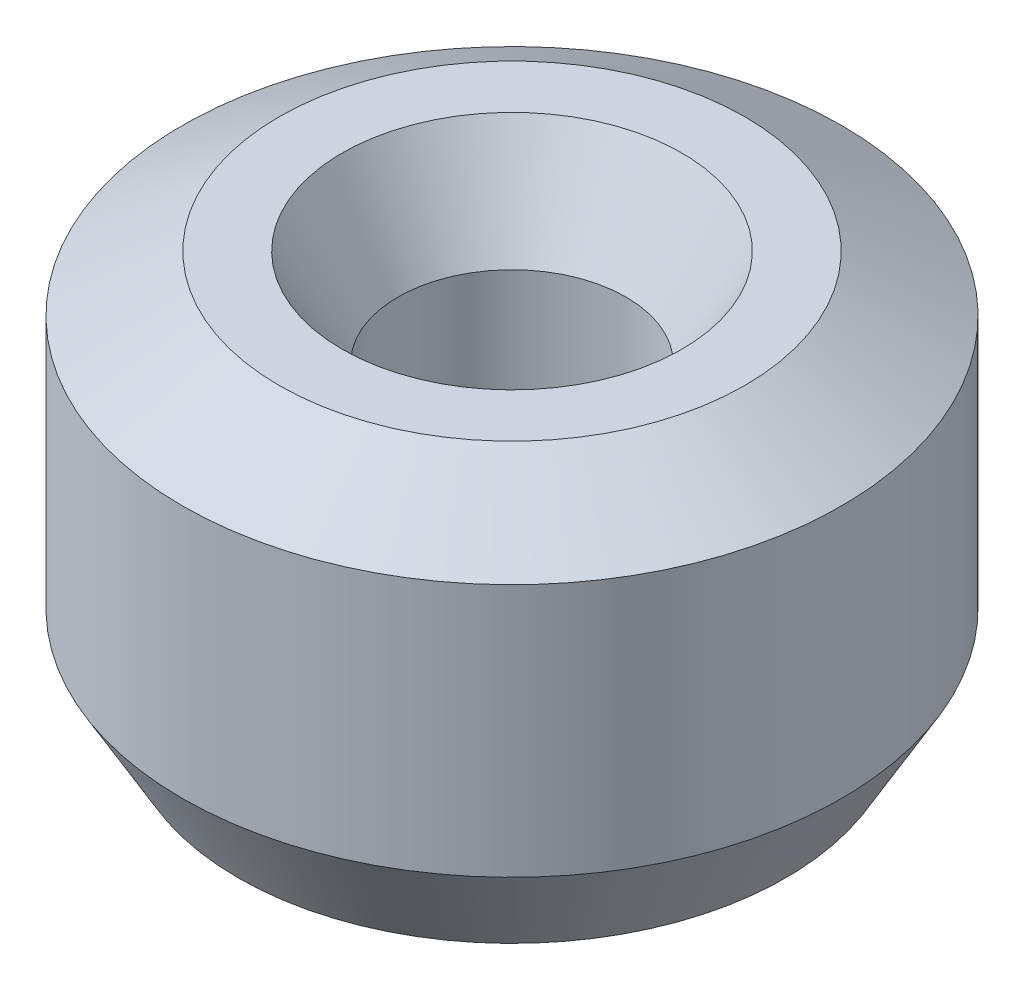
ISO-10303-21;
HEADER;
FILE_DESCRIPTION(('STEP AP214'),'2;1');
FILE_NAME('part.step','',(''),(''),'','','');
FILE_SCHEMA(('AUTOMOTIVE_DESIGN { 1 0 10303 214 1 1 1 1 }'));
ENDSEC;
DATA;
#1=APPLICATION_CONTEXT('core data for automotive mechanical design processes');
#2=APPLICATION_PROTOCOL_DEFINITION('international standard','automotive_design',2000,#1);
#3=PRODUCT_CONTEXT('',#1,'mechanical');
#4=PRODUCT('Part','Part','',(#3));
#5=PRODUCT_RELATED_PRODUCT_CATEGORY('part','',(#4));
#6=PRODUCT_DEFINITION_FORMATION('','',#4);
#7=PRODUCT_DEFINITION_CONTEXT('part definition',#1,'design');
#8=PRODUCT_DEFINITION('design','',#6,#7);
#9=PRODUCT_DEFINITION_SHAPE('','',#8);
#10=(LENGTH_UNIT() NAMED_UNIT(*) SI_UNIT(.MILLI.,.METRE.));
#11=(NAMED_UNIT(*) PLANE_ANGLE_UNIT() SI_UNIT($,.RADIAN.));
#12=(NAMED_UNIT(*) SI_UNIT($,.STERADIAN.) SOLID_ANGLE_UNIT());
#13=UNCERTAINTY_MEASURE_WITH_UNIT(LENGTH_MEASURE(1.E-05),#10,'distance_accuracy_value','');
#14=(GEOMETRIC_REPRESENTATION_CONTEXT(3) GLOBAL_UNCERTAINTY_ASSIGNED_CONTEXT((#13)) GLOBAL_UNIT_ASSIGNED_CONTEXT((#10,
#11,#12)) REPRESENTATION_CONTEXT('',''));
#15=CARTESIAN_POINT('',(0.,0.,0.));
#16=DIRECTION('',(0.,0.,1.));
#17=DIRECTION('',(1.,0.,0.));
#18=AXIS2_PLACEMENT_3D('',#15,#16,#17);
#19=CARTESIAN_POINT('',(0.,6.16033131752861,0.));
#20=DIRECTION('',(0.,-1.,0.));
#21=DIRECTION('',(0.,0.,-1.));
#22=AXIS2_PLACEMENT_3D('',#19,#20,#21);
#23=CYLINDRICAL_SURFACE('',#22,5.);
#24=CARTESIAN_POINT('',(0.,1.46824299427012,0.));
#25=DIRECTION('',(0.,1.,0.));
#26=DIRECTION('',(0.,0.,1.));
#27=AXIS2_PLACEMENT_3D('',#24,#25,#26);
#28=CIRCLE('',#27,5.);
#29=CARTESIAN_POINT('',(0.,1.46824299427012,-5.));
#30=VERTEX_POINT('',#29);
#31=EDGE_CURVE('E10',#30,#30,#28,.T.);
#32=CARTESIAN_POINT('',(0.,5.31264082955098,0.));
#33=DIRECTION('',(0.,1.,0.));
#34=DIRECTION('',(0.,0.,1.));
#35=AXIS2_PLACEMENT_3D('',#32,#33,#34);
#36=CIRCLE('',#35,5.);
#37=CARTESIAN_POINT('',(0.,5.31264082955098,-5.));
#38=VERTEX_POINT('',#37);
#39=EDGE_CURVE('E50',#38,#38,#36,.F.);
#40=CARTESIAN_POINT('',(0.,1.46824299427012,-5.));
#41=CARTESIAN_POINT('',(0.,1.5082888050543,-5.));
#42=CARTESIAN_POINT('',(0.,1.54833461583847,-5.));
#43=CARTESIAN_POINT('',(0.,1.62842623740682,-5.));
#44=CARTESIAN_POINT('',(0.,1.668472048191,-5.));
#45=CARTESIAN_POINT('',(0.,1.74856366975935,-5.));
#46=CARTESIAN_POINT('',(0.,1.78860948054353,-5.));
#47=CARTESIAN_POINT('',(0.,1.86870110211188,-5.));
#48=CARTESIAN_POINT('',(0.,1.90874691289605,-5.));
#49=CARTESIAN_POINT('',(0.,1.9888385344644,-5.));
#50=CARTESIAN_POINT('',(0.,2.02888434524858,-5.));
#51=CARTESIAN_POINT('',(0.,2.10897596681693,-5.));
#52=CARTESIAN_POINT('',(0.,2.14902177760111,-5.));
#53=CARTESIAN_POINT('',(0.,2.22911339916946,-5.));
#54=CARTESIAN_POINT('',(0.,2.26915920995363,-5.));
#55=CARTESIAN_POINT('',(0.,2.34925083152198,-5.));
#56=CARTESIAN_POINT('',(0.,2.38929664230616,-5.));
#57=CARTESIAN_POINT('',(0.,2.46938826387451,-5.));
#58=CARTESIAN_POINT('',(0.,2.50943407465869,-5.));
#59=CARTESIAN_POINT('',(0.,2.58952569622704,-5.));
#60=CARTESIAN_POINT('',(0.,2.62957150701121,-5.));
#61=CARTESIAN_POINT('',(0.,2.70966312857957,-5.));
#62=CARTESIAN_POINT('',(0.,2.74970893936374,-5.));
#63=CARTESIAN_POINT('',(0.,2.82980056093209,-5.));
#64=CARTESIAN_POINT('',(0.,2.86984637171627,-5.));
#65=CARTESIAN_POINT('',(0.,2.94993799328462,-5.));
#66=CARTESIAN_POINT('',(0.,2.98998380406879,-5.));
#67=CARTESIAN_POINT('',(0.,3.07007542563715,-5.));
#68=CARTESIAN_POINT('',(0.,3.11012123642132,-5.));
#69=CARTESIAN_POINT('',(0.,3.19021285798967,-5.));
#70=CARTESIAN_POINT('',(0.,3.23025866877385,-5.));
#71=CARTESIAN_POINT('',(0.,3.3103502903422,-5.));
#72=CARTESIAN_POINT('',(0.,3.35039610112638,-5.));
#73=CARTESIAN_POINT('',(0.,3.43048772269473,-5.));
#74=CARTESIAN_POINT('',(0.,3.4705335334789,-5.));
#75=CARTESIAN_POINT('',(0.,3.55062515504725,-5.));
#76=CARTESIAN_POINT('',(0.,3.59067096583143,-5.));
#77=CARTESIAN_POINT('',(0.,3.67076258739978,-5.));
#78=CARTESIAN_POINT('',(0.,3.71080839818396,-5.));
#79=CARTESIAN_POINT('',(0.,3.79090001975231,-5.));
#80=CARTESIAN_POINT('',(0.,3.83094583053648,-5.));
#81=CARTESIAN_POINT('',(0.,3.91103745210484,-5.));
#82=CARTESIAN_POINT('',(0.,3.95108326288901,-5.));
#83=CARTESIAN_POINT('',(0.,4.03117488445736,-5.));
#84=CARTESIAN_POINT('',(0.,4.07122069524154,-5.));
#85=CARTESIAN_POINT('',(0.,4.15131231680989,-5.));
#86=CARTESIAN_POINT('',(0.,4.19135812759406,-5.));
#87=CARTESIAN_POINT('',(0.,4.27144974916242,-5.));
#88=CARTESIAN_POINT('',(0.,4.31149555994659,-5.));
#89=CARTESIAN_POINT('',(0.,4.39158718151494,-5.));
#90=CARTESIAN_POINT('',(0.,4.43163299229912,-5.));
#91=CARTESIAN_POINT('',(0.,4.51172461386747,-5.));
#92=CARTESIAN_POINT('',(0.,4.55177042465165,-5.));
#93=CARTESIAN_POINT('',(0.,4.63186204622,-5.));
#94=CARTESIAN_POINT('',(0.,4.67190785700417,-5.));
#95=CARTESIAN_POINT('',(0.,4.75199947857252,-5.));
#96=CARTESIAN_POINT('',(0.,4.7920452893567,-5.));
#97=CARTESIAN_POINT('',(0.,4.87213691092505,-5.));
#98=CARTESIAN_POINT('',(0.,4.91218272170923,-5.));
#99=CARTESIAN_POINT('',(0.,4.99227434327758,-5.));
#100=CARTESIAN_POINT('',(0.,5.03232015406175,-5.));
#101=CARTESIAN_POINT('',(0.,5.1124117756301,-5.));
#102=CARTESIAN_POINT('',(0.,5.15245758641428,-5.));
#103=CARTESIAN_POINT('',(0.,5.23254920798263,-5.));
#104=CARTESIAN_POINT('',(0.,5.27259501876681,-5.));
#105=CARTESIAN_POINT('',(0.,5.31264082955098,-5.));
#106=B_SPLINE_CURVE_WITH_KNOTS('',3,(#40,#41,#42,#43,#44,#45,#46,#47,#48,#49,#50,#51,#52,#53,
#54,#55,#56,#57,#58,#59,#60,#61,#62,#63,#64,#65,#66,#67,#68,#69,#70,#71,#72,#73,#74,#75,#76,#77,
#78,#79,#80,#81,#82,#83,#84,#85,#86,#87,#88,#89,#90,#91,#92,#93,#94,#95,#96,#97,#98,#99,#100,
#101,#102,#103,#104,#105),.UNSPECIFIED.,.F.,.F.,(4,2,2,2,2,2,2,2,2,2,2,2,2,2,2,2,2,2,2,2,2,2,2,
2,2,2,2,2,2,2,2,2,4),(0.,0.120137432352527,0.240274864705054,0.360412297057581,
0.480549729410108,0.600687161762635,0.720824594115162,0.840962026467688,0.961099458820216,
1.08123689117274,1.20137432352527,1.3215117558778,1.44164918823032,1.56178662058285,
1.68192405293538,1.8020614852879,1.92219891764043,2.04233634999296,2.16247378234549,
2.28261121469801,2.40274864705054,2.52288607940307,2.64302351175559,2.76316094410812,
2.88329837646065,3.00343580881317,3.1235732411657,3.24371067351823,3.36384810587075,
3.48398553822328,3.60412297057581,3.72426040292834,3.84439783528086),.UNSPECIFIED.);
#107=EDGE_CURVE('BSEAM39',#30,#38,#106,.T.);
#108=ORIENTED_EDGE('',*,*,#31,.T.);
#109=ORIENTED_EDGE('',*,*,#39,.T.);
#110=ORIENTED_EDGE('',*,*,#107,.T.);
#111=ORIENTED_EDGE('',*,*,#107,.F.);
#112=EDGE_LOOP('',(#108,#110,#109,#111));
#113=FACE_BOUND('',#112,.T.);
#114=ADVANCED_FACE('F39',(#113),#23,.T.);
#115=CARTESIAN_POINT('',(0.,6.16033131752861,0.));
#116=DIRECTION('',(0.,1.,0.));
#117=DIRECTION('',(0.,0.,1.));
#118=AXIS2_PLACEMENT_3D('',#115,#116,#117);
#119=PLANE('',#118);
#120=CARTESIAN_POINT('',(0.,6.16033131752861,0.));
#121=DIRECTION('',(0.,1.,0.));
#122=DIRECTION('',(0.,0.,1.));
#123=AXIS2_PLACEMENT_3D('',#120,#121,#122);
#124=CIRCLE('',#123,2.57860352945368);
#125=CARTESIAN_POINT('',(0.,6.16033131752861,2.57860352945368));
#126=VERTEX_POINT('',#125);
#127=EDGE_CURVE('E58',#126,#126,#124,.F.);
#128=ORIENTED_EDGE('',*,*,#127,.T.);
#129=EDGE_LOOP('',(#128));
#130=FACE_BOUND('',#129,.T.);
#131=CARTESIAN_POINT('',(0.,6.16033131752861,0.));
#132=DIRECTION('',(0.,1.,0.));
#133=DIRECTION('',(0.,0.,1.));
#134=AXIS2_PLACEMENT_3D('',#131,#132,#133);
#135=CIRCLE('',#134,3.53175700572991);
#136=CARTESIAN_POINT('',(0.,6.16033131752861,3.53175700572991));
#137=VERTEX_POINT('',#136);
#138=EDGE_CURVE('E61',#137,#137,#135,.T.);
#139=ORIENTED_EDGE('',*,*,#138,.T.);
#140=EDGE_LOOP('',(#139));
#141=FACE_BOUND('',#140,.T.);
#142=ADVANCED_FACE('F88',(#130,#141),#119,.T.);
#143=CARTESIAN_POINT('',(0.,0.,0.));
#144=DIRECTION('',(0.,1.,0.));
#145=DIRECTION('',(0.,0.,1.));
#146=AXIS2_PLACEMENT_3D('',#143,#144,#145);
#147=PLANE('',#146);
#148=CARTESIAN_POINT('',(0.,0.,0.));
#149=DIRECTION('',(0.,1.,0.));
#150=DIRECTION('',(0.,0.,1.));
#151=AXIS2_PLACEMENT_3D('',#148,#149,#150);
#152=CIRCLE('',#151,3.19915603574612);
#153=CARTESIAN_POINT('',(0.,0.,3.19915603574612));
#154=VERTEX_POINT('',#153);
#155=EDGE_CURVE('E51',#154,#154,#152,.T.);
#156=ORIENTED_EDGE('',*,*,#155,.T.);
#157=EDGE_LOOP('',(#156));
#158=FACE_BOUND('',#157,.T.);
#159=CARTESIAN_POINT('',(0.,0.,0.));
#160=DIRECTION('',(0.,1.,0.));
#161=DIRECTION('',(0.,0.,1.));
#162=AXIS2_PLACEMENT_3D('',#159,#160,#161);
#163=CIRCLE('',#162,4.15230951202236);
#164=CARTESIAN_POINT('',(0.,0.,4.15230951202236));
#165=VERTEX_POINT('',#164);
#166=EDGE_CURVE('E54',#165,#165,#163,.F.);
#167=ORIENTED_EDGE('',*,*,#166,.T.);
#168=EDGE_LOOP('',(#167));
#169=FACE_BOUND('',#168,.T.);
#170=ADVANCED_FACE('F83',(#158,#169),#147,.F.);
#171=CARTESIAN_POINT('',(0.,6.16033131752861,0.));
#172=DIRECTION('',(0.,-1.,0.));
#173=DIRECTION('',(0.,0.,-1.));
#174=AXIS2_PLACEMENT_3D('',#171,#172,#173);
#175=CYLINDRICAL_SURFACE('',#174,1.73091304147604);
#176=CARTESIAN_POINT('',(0.,4.69208832325849,0.));
#177=DIRECTION('',(0.,1.,0.));
#178=DIRECTION('',(0.,0.,1.));
#179=AXIS2_PLACEMENT_3D('',#176,#177,#178);
#180=CIRCLE('',#179,1.73091304147604);
#181=CARTESIAN_POINT('',(0.,4.69208832325849,-1.73091304147604));
#182=VERTEX_POINT('',#181);
#183=EDGE_CURVE('E67',#182,#182,#180,.T.);
#184=CARTESIAN_POINT('',(0.,0.847690487977625,0.));
#185=DIRECTION('',(0.,1.,0.));
#186=DIRECTION('',(0.,0.,1.));
#187=AXIS2_PLACEMENT_3D('',#184,#185,#186);
#188=CIRCLE('',#187,1.73091304147604);
#189=CARTESIAN_POINT('',(0.,0.847690487977624,-1.73091304147604));
#190=VERTEX_POINT('',#189);
#191=EDGE_CURVE('E69',#190,#190,#188,.F.);
#192=CARTESIAN_POINT('',(0.,4.69208832325849,-1.73091304147604));
#193=CARTESIAN_POINT('',(0.,4.65204251247432,-1.73091304147604));
#194=CARTESIAN_POINT('',(0.,4.61199670169014,-1.73091304147604));
#195=CARTESIAN_POINT('',(0.,4.53190508012179,-1.73091304147604));
#196=CARTESIAN_POINT('',(0.,4.49185926933761,-1.73091304147604));
#197=CARTESIAN_POINT('',(0.,4.41176764776926,-1.73091304147604));
#198=CARTESIAN_POINT('',(0.,4.37172183698509,-1.73091304147604));
#199=CARTESIAN_POINT('',(0.,4.29163021541673,-1.73091304147604));
#200=CARTESIAN_POINT('',(0.,4.25158440463256,-1.73091304147604));
#201=CARTESIAN_POINT('',(0.,4.17149278306421,-1.73091304147604));
#202=CARTESIAN_POINT('',(0.,4.13144697228003,-1.73091304147604));
#203=CARTESIAN_POINT('',(0.,4.05135535071168,-1.73091304147604));
#204=CARTESIAN_POINT('',(0.,4.0113095399275,-1.73091304147604));
#205=CARTESIAN_POINT('',(0.,3.93121791835915,-1.73091304147604));
#206=CARTESIAN_POINT('',(0.,3.89117210757498,-1.73091304147604));
#207=CARTESIAN_POINT('',(0.,3.81108048600663,-1.73091304147604));
#208=CARTESIAN_POINT('',(0.,3.77103467522245,-1.73091304147604));
#209=CARTESIAN_POINT('',(0.,3.6909430536541,-1.73091304147604));
#210=CARTESIAN_POINT('',(0.,3.65089724286992,-1.73091304147604));
#211=CARTESIAN_POINT('',(0.,3.57080562130157,-1.73091304147604));
#212=CARTESIAN_POINT('',(0.,3.5307598105174,-1.73091304147604));
#213=CARTESIAN_POINT('',(0.,3.45066818894904,-1.73091304147604));
#214=CARTESIAN_POINT('',(0.,3.41062237816487,-1.73091304147604));
#215=CARTESIAN_POINT('',(0.,3.33053075659652,-1.73091304147604));
#216=CARTESIAN_POINT('',(0.,3.29048494581234,-1.73091304147604));
#217=CARTESIAN_POINT('',(0.,3.21039332424399,-1.73091304147604));
#218=CARTESIAN_POINT('',(0.,3.17034751345981,-1.73091304147604));
#219=CARTESIAN_POINT('',(0.,3.09025589189146,-1.73091304147604));
#220=CARTESIAN_POINT('',(0.,3.05021008110729,-1.73091304147604));
#221=CARTESIAN_POINT('',(0.,2.97011845953894,-1.73091304147604));
#222=CARTESIAN_POINT('',(0.,2.93007264875476,-1.73091304147604));
#223=CARTESIAN_POINT('',(0.,2.84998102718641,-1.73091304147604));
#224=CARTESIAN_POINT('',(0.,2.80993521640223,-1.73091304147604));
#225=CARTESIAN_POINT('',(0.,2.72984359483388,-1.73091304147604));
#226=CARTESIAN_POINT('',(0.,2.68979778404971,-1.73091304147604));
#227=CARTESIAN_POINT('',(0.,2.60970616248135,-1.73091304147604));
#228=CARTESIAN_POINT('',(0.,2.56966035169718,-1.73091304147604));
#229=CARTESIAN_POINT('',(0.,2.48956873012883,-1.73091304147604));
#230=CARTESIAN_POINT('',(0.,2.44952291934465,-1.73091304147604));
#231=CARTESIAN_POINT('',(0.,2.3694312977763,-1.73091304147604));
#232=CARTESIAN_POINT('',(0.,2.32938548699212,-1.73091304147604));
#233=CARTESIAN_POINT('',(0.,2.24929386542377,-1.73091304147604));
#234=CARTESIAN_POINT('',(0.,2.2092480546396,-1.73091304147604));
#235=CARTESIAN_POINT('',(0.,2.12915643307125,-1.73091304147604));
#236=CARTESIAN_POINT('',(0.,2.08911062228707,-1.73091304147604));
#237=CARTESIAN_POINT('',(0.,2.00901900071872,-1.73091304147604));
#238=CARTESIAN_POINT('',(0.,1.96897318993454,-1.73091304147604));
#239=CARTESIAN_POINT('',(0.,1.88888156836619,-1.73091304147604));
#240=CARTESIAN_POINT('',(0.,1.84883575758202,-1.73091304147604));
#241=CARTESIAN_POINT('',(0.,1.76874413601367,-1.73091304147604));
#242=CARTESIAN_POINT('',(0.,1.72869832522949,-1.73091304147604));
#243=CARTESIAN_POINT('',(0.,1.64860670366114,-1.73091304147604));
#244=CARTESIAN_POINT('',(0.,1.60856089287696,-1.73091304147604));
#245=CARTESIAN_POINT('',(0.,1.52846927130861,-1.73091304147604));
#246=CARTESIAN_POINT('',(0.,1.48842346052444,-1.73091304147604));
#247=CARTESIAN_POINT('',(0.,1.40833183895608,-1.73091304147604));
#248=CARTESIAN_POINT('',(0.,1.36828602817191,-1.73091304147604));
#249=CARTESIAN_POINT('',(0.,1.28819440660356,-1.73091304147604));
#250=CARTESIAN_POINT('',(0.,1.24814859581938,-1.73091304147604));
#251=CARTESIAN_POINT('',(0.,1.16805697425103,-1.73091304147604));
#252=CARTESIAN_POINT('',(0.,1.12801116346685,-1.73091304147604));
#253=CARTESIAN_POINT('',(0.,1.0479195418985,-1.73091304147604));
#254=CARTESIAN_POINT('',(0.,1.00787373111433,-1.73091304147604));
#255=CARTESIAN_POINT('',(0.,0.927782109545976,-1.73091304147604));
#256=CARTESIAN_POINT('',(0.,0.8877362987618,-1.73091304147604));
#257=CARTESIAN_POINT('',(0.,0.847690487977624,-1.73091304147604));
#258=B_SPLINE_CURVE_WITH_KNOTS('',3,(#192,#193,#194,#195,#196,#197,#198,#199,#200,#201,#202,
#203,#204,#205,#206,#207,#208,#209,#210,#211,#212,#213,#214,#215,#216,#217,#218,#219,#220,#221,
#222,#223,#224,#225,#226,#227,#228,#229,#230,#231,#232,#233,#234,#235,#236,#237,#238,#239,#240,
#241,#242,#243,#244,#245,#246,#247,#248,#249,#250,#251,#252,#253,#254,#255,#256,#257),
.UNSPECIFIED.,.F.,.F.,(4,2,2,2,2,2,2,2,2,2,2,2,2,2,2,2,2,2,2,2,2,2,2,2,2,2,2,2,2,2,2,2,4),(0.,
0.120137432352527,0.240274864705054,0.360412297057581,0.480549729410108,0.600687161762634,
0.720824594115163,0.840962026467689,0.961099458820217,1.08123689117274,1.20137432352527,
1.3215117558778,1.44164918823032,1.56178662058285,1.68192405293538,1.80206148528791,
1.92219891764043,2.04233634999296,2.16247378234549,2.28261121469801,2.40274864705054,
2.52288607940307,2.6430235117556,2.76316094410812,2.88329837646065,3.00343580881318,
3.1235732411657,3.24371067351823,3.36384810587076,3.48398553822329,3.60412297057581,
3.72426040292834,3.84439783528087),.UNSPECIFIED.);
#259=EDGE_CURVE('BSEAM71',#182,#190,#258,.T.);
#260=ORIENTED_EDGE('',*,*,#183,.T.);
#261=ORIENTED_EDGE('',*,*,#191,.T.);
#262=ORIENTED_EDGE('',*,*,#259,.T.);
#263=ORIENTED_EDGE('',*,*,#259,.F.);
#264=EDGE_LOOP('',(#260,#262,#261,#263));
#265=FACE_BOUND('',#264,.T.);
#266=ADVANCED_FACE('F71',(#265),#175,.F.);
#267=CARTESIAN_POINT('',(0.,4.69208832325849,0.));
#268=DIRECTION('',(0.,1.,0.));
#269=DIRECTION('',(0.,0.,1.));
#270=AXIS2_PLACEMENT_3D('',#267,#268,#269);
#271=CONICAL_SURFACE('',#270,1.73091304147604,0.523598775598302);
#272=ORIENTED_EDGE('',*,*,#127,.F.);
#273=EDGE_LOOP('',(#272));
#274=FACE_BOUND('',#273,.T.);
#275=ORIENTED_EDGE('',*,*,#183,.F.);
#276=EDGE_LOOP('',(#275));
#277=FACE_BOUND('',#276,.T.);
#278=ADVANCED_FACE('F77',(#274,#277),#271,.F.);
#279=CARTESIAN_POINT('',(0.,0.,0.));
#280=DIRECTION('',(0.,-1.,0.));
#281=DIRECTION('',(0.,0.,-1.));
#282=AXIS2_PLACEMENT_3D('',#279,#280,#281);
#283=CONICAL_SURFACE('',#282,3.19915603574612,1.04719755119659);
#284=ORIENTED_EDGE('',*,*,#191,.F.);
#285=EDGE_LOOP('',(#284));
#286=FACE_BOUND('',#285,.T.);
#287=ORIENTED_EDGE('',*,*,#155,.F.);
#288=EDGE_LOOP('',(#287));
#289=FACE_BOUND('',#288,.T.);
#290=ADVANCED_FACE('F73',(#286,#289),#283,.F.);
#291=CARTESIAN_POINT('',(0.,1.46824299427012,0.));
#292=DIRECTION('',(0.,1.,0.));
#293=DIRECTION('',(0.,0.,1.));
#294=AXIS2_PLACEMENT_3D('',#291,#292,#293);
#295=CONICAL_SURFACE('',#294,5.,0.523598775598303);
#296=ORIENTED_EDGE('',*,*,#166,.F.);
#297=EDGE_LOOP('',(#296));
#298=FACE_BOUND('',#297,.T.);
#299=ORIENTED_EDGE('',*,*,#31,.F.);
#300=EDGE_LOOP('',(#299));
#301=FACE_BOUND('',#300,.T.);
#302=ADVANCED_FACE('F76',(#298,#301),#295,.T.);
#303=CARTESIAN_POINT('',(0.,6.16033131752861,0.));
#304=DIRECTION('',(0.,-1.,0.));
#305=DIRECTION('',(0.,0.,-1.));
#306=AXIS2_PLACEMENT_3D('',#303,#304,#305);
#307=CONICAL_SURFACE('',#306,3.53175700572991,1.0471975511966);
#308=ORIENTED_EDGE('',*,*,#39,.F.);
#309=EDGE_LOOP('',(#308));
#310=FACE_BOUND('',#309,.T.);
#311=ORIENTED_EDGE('',*,*,#138,.F.);
#312=EDGE_LOOP('',(#311));
#313=FACE_BOUND('',#312,.T.);
#314=ADVANCED_FACE('F45',(#310,#313),#307,.T.);
#315=CLOSED_SHELL('',(#114,#142,#170,#266,#278,#290,#302,#314));
#316=MANIFOLD_SOLID_BREP('B2',#315);
#317=ADVANCED_BREP_SHAPE_REPRESENTATION('',(#18,#316),#14);
#318=SHAPE_DEFINITION_REPRESENTATION(#9,#317);
ENDSEC;
END-ISO-10303-21;
